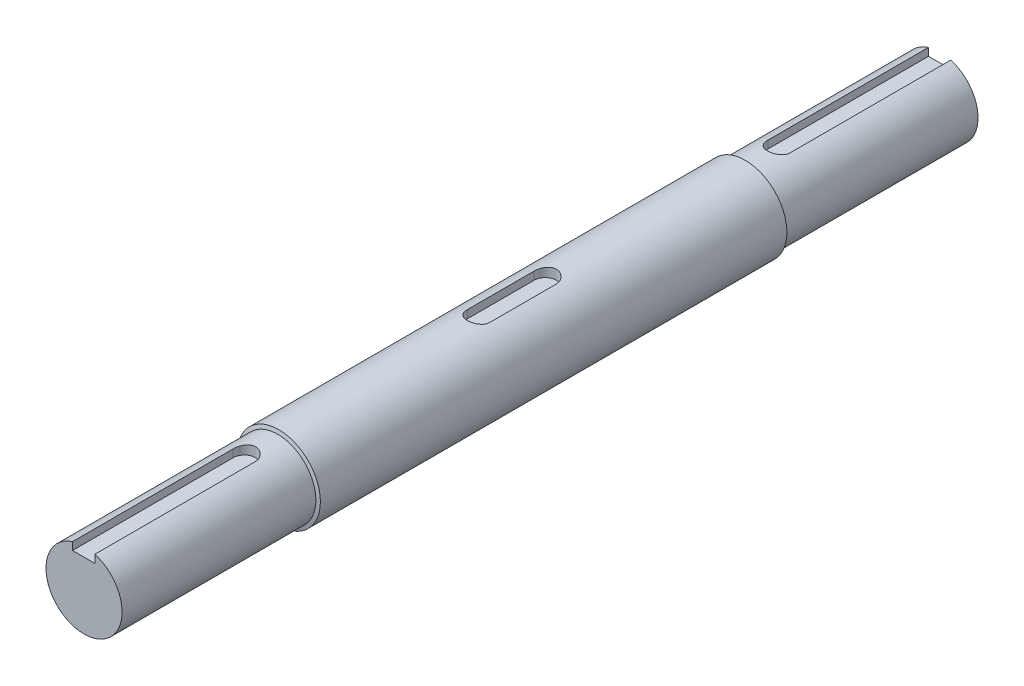
ISO-10303-21;
HEADER;
FILE_DESCRIPTION(('STEP AP214'),'2;1');
FILE_NAME('part.step','',(''),(''),'','','');
FILE_SCHEMA(('AUTOMOTIVE_DESIGN { 1 0 10303 214 1 1 1 1 }'));
ENDSEC;
DATA;
#1=APPLICATION_CONTEXT('core data for automotive mechanical design processes');
#2=APPLICATION_PROTOCOL_DEFINITION('international standard','automotive_design',2000,#1);
#3=PRODUCT_CONTEXT('',#1,'mechanical');
#4=PRODUCT('Part','Part','',(#3));
#5=PRODUCT_RELATED_PRODUCT_CATEGORY('part','',(#4));
#6=PRODUCT_DEFINITION_FORMATION('','',#4);
#7=PRODUCT_DEFINITION_CONTEXT('part definition',#1,'design');
#8=PRODUCT_DEFINITION('design','',#6,#7);
#9=PRODUCT_DEFINITION_SHAPE('','',#8);
#10=(LENGTH_UNIT() NAMED_UNIT(*) SI_UNIT(.MILLI.,.METRE.));
#11=(NAMED_UNIT(*) PLANE_ANGLE_UNIT() SI_UNIT($,.RADIAN.));
#12=(NAMED_UNIT(*) SI_UNIT($,.STERADIAN.) SOLID_ANGLE_UNIT());
#13=UNCERTAINTY_MEASURE_WITH_UNIT(LENGTH_MEASURE(1.E-05),#10,'distance_accuracy_value','');
#14=(GEOMETRIC_REPRESENTATION_CONTEXT(3) GLOBAL_UNCERTAINTY_ASSIGNED_CONTEXT((#13)) GLOBAL_UNIT_ASSIGNED_CONTEXT((#10,
#11,#12)) REPRESENTATION_CONTEXT('',''));
#15=CARTESIAN_POINT('',(0.,0.,0.));
#16=DIRECTION('',(0.,0.,1.));
#17=DIRECTION('',(1.,0.,0.));
#18=AXIS2_PLACEMENT_3D('',#15,#16,#17);
#19=CARTESIAN_POINT('',(0.,0.,180.));
#20=DIRECTION('',(0.,0.,-1.));
#21=DIRECTION('',(-1.,0.,0.));
#22=AXIS2_PLACEMENT_3D('',#19,#20,#21);
#23=CYLINDRICAL_SURFACE('',#22,8.75);
#24=CARTESIAN_POINT('',(0.,0.,40.95));
#25=DIRECTION('',(0.,0.,-1.));
#26=DIRECTION('',(-1.,0.,0.));
#27=AXIS2_PLACEMENT_3D('',#24,#25,#26);
#28=CIRCLE('',#27,8.75);
#29=CARTESIAN_POINT('',(-8.75,0.,40.95));
#30=VERTEX_POINT('',#29);
#31=EDGE_CURVE('E156',#30,#30,#28,.T.);
#32=ORIENTED_EDGE('',*,*,#31,.F.);
#33=EDGE_LOOP('',(#32));
#34=FACE_BOUND('',#33,.T.);
#35=CARTESIAN_POINT('',(-2.34999999999999,8.42852300228219,97.));
#36=CARTESIAN_POINT('',(-2.35000771204887,8.4285151174792,97.0648172031479));
#37=CARTESIAN_POINT('',(-2.34731846603423,8.42927051196659,97.1296297014604));
#38=CARTESIAN_POINT('',(-2.33660599132982,8.43224933902164,97.2587665927357));
#39=CARTESIAN_POINT('',(-2.32858376438728,8.43447249588425,97.323091075073));
#40=CARTESIAN_POINT('',(-2.30728834882773,8.44032201481819,97.4506593799532));
#41=CARTESIAN_POINT('',(-2.29402659181791,8.44394532166753,97.5139052445157));
#42=CARTESIAN_POINT('',(-2.26237773894829,8.45247973149428,97.6389952606388));
#43=CARTESIAN_POINT('',(-2.24399055073495,8.4573908576764,97.70083938692));
#44=CARTESIAN_POINT('',(-2.18135092398383,8.47384783119091,97.8836024908178));
#45=CARTESIAN_POINT('',(-2.12959682925498,8.48712416960618,98.001892160052));
#46=CARTESIAN_POINT('',(-2.0076925166483,8.51678234776292,98.2280936899011));
#47=CARTESIAN_POINT('',(-1.9375360868314,8.53316523564069,98.3360020293245));
#48=CARTESIAN_POINT('',(-1.77891363685566,8.56765357847724,98.541150977134));
#49=CARTESIAN_POINT('',(-1.69006718175684,8.5857897557295,98.6380928370493));
#50=CARTESIAN_POINT('',(-1.49740282381337,8.62147716733614,98.8158954324731));
#51=CARTESIAN_POINT('',(-1.39358249043802,8.63902830615774,98.8967535522212));
#52=CARTESIAN_POINT('',(-1.17182881312,8.67191238058831,99.0413512176625));
#53=CARTESIAN_POINT('',(-1.05369341466077,8.68720460121444,99.1047909900506));
#54=CARTESIAN_POINT('',(-0.807959753714074,8.71349215200275,99.2107909503317));
#55=CARTESIAN_POINT('',(-0.680363561497582,8.72448841895047,99.2533556907996));
#56=CARTESIAN_POINT('',(-0.422467970577286,8.74072764178795,99.3154266767051));
#57=CARTESIAN_POINT('',(-0.292300027050153,8.74609819441226,99.3354451241938));
#58=CARTESIAN_POINT('',(-0.030347109309733,8.75092723361248,99.3534672046057));
#59=CARTESIAN_POINT('',(0.10143762269478,8.75038659518875,99.3514740957754));
#60=CARTESIAN_POINT('',(0.359310851304423,8.74354724609422,99.3258886015563));
#61=CARTESIAN_POINT('',(0.485458821243554,8.73739620732177,99.3028501297881));
#62=CARTESIAN_POINT('',(0.732026606865527,8.72020183006266,99.2367235542361));
#63=CARTESIAN_POINT('',(0.852446148769855,8.70915825800697,99.1936344932343));
#64=CARTESIAN_POINT('',(1.08555024748539,8.68320131789818,99.0882075948791));
#65=CARTESIAN_POINT('',(1.19814487031626,8.66825016135818,99.0256805966078));
#66=CARTESIAN_POINT('',(1.41142943998828,8.6360880788214,98.8832990555831));
#67=CARTESIAN_POINT('',(1.51211726691846,8.61887675156686,98.8034414344032));
#68=CARTESIAN_POINT('',(1.7020286722977,8.58342761101692,98.6257394572387));
#69=CARTESIAN_POINT('',(1.79079960347115,8.56517451788743,98.527413891673));
#70=CARTESIAN_POINT('',(1.95072314362797,8.53017594794363,98.3170557481245));
#71=CARTESIAN_POINT('',(2.02187086871643,8.5134308898654,98.2050193833099));
#72=CARTESIAN_POINT('',(2.14488641866991,8.48327861851133,97.9694080433701));
#73=CARTESIAN_POINT('',(2.1966186826984,8.46989508250728,97.8457592092002));
#74=CARTESIAN_POINT('',(2.27834723396409,8.44828094060744,97.5911402998802));
#75=CARTESIAN_POINT('',(2.30837619972965,8.44004259018832,97.4601815528779));
#76=CARTESIAN_POINT('',(2.33469186877106,8.4327788164002,97.2733793258763));
#77=CARTESIAN_POINT('',(2.34043288160869,8.43118569871097,97.2188299041686));
#78=CARTESIAN_POINT('',(2.34808291238573,8.42905806161571,97.1095291640811));
#79=CARTESIAN_POINT('',(2.34999797240023,8.42852187308899,97.0547783010573));
#80=CARTESIAN_POINT('',(2.35000000000001,8.42852300228219,97.));
#81=B_SPLINE_CURVE_WITH_KNOTS('',3,(#35,#36,#37,#38,#39,#40,#41,#42,#43,#44,#45,#46,#47,#48,#49,
#50,#51,#52,#53,#54,#55,#56,#57,#58,#59,#60,#61,#62,#63,#64,#65,#66,#67,#68,#69,#70,#71,#72,#73,
#74,#75,#76,#77,#78,#79,#80),.UNSPECIFIED.,.F.,.F.,(4,2,2,2,2,2,2,2,2,2,2,2,2,2,2,2,2,2,2,2,2,2,
4),(0.,0.194383367532063,0.38873023240231,0.582655392353598,0.776584046807006,1.16402038978287,
1.55158768544152,1.94797731856433,2.34443136544133,2.74733270682689,3.1501461415145,
3.54361134286724,3.93701830256871,4.32036010008819,4.70372020027673,5.09093437952323,
5.47821739573037,5.87751700091898,6.27692713996469,6.67907629668806,7.08061867112352,
7.24512305897556,7.40936744988177),.UNSPECIFIED.);
#82=CARTESIAN_POINT('',(-2.34999999999999,8.4285230022822,97.));
#83=VERTEX_POINT('',#82);
#84=CARTESIAN_POINT('',(2.35000000000001,8.42852300228218,97.));
#85=VERTEX_POINT('',#84);
#86=EDGE_CURVE('E39',#83,#85,#81,.T.);
#87=ORIENTED_EDGE('',*,*,#86,.F.);
#88=DIRECTION('',(0.,0.,-1.));
#89=VECTOR('',#88,1.);
#90=CARTESIAN_POINT('',(-2.34999999999997,8.4285230022822,180.));
#91=LINE('',#90,#89);
#92=CARTESIAN_POINT('',(-2.34999999999997,8.4285230022822,83.));
#93=VERTEX_POINT('',#92);
#94=EDGE_CURVE('E220',#93,#83,#91,.F.);
#95=ORIENTED_EDGE('',*,*,#94,.F.);
#96=CARTESIAN_POINT('',(2.35,8.42852300228219,83.));
#97=CARTESIAN_POINT('',(2.35000771204888,8.4285151174792,82.935182796852));
#98=CARTESIAN_POINT('',(2.34731846603423,8.42927051196659,82.8703702985396));
#99=CARTESIAN_POINT('',(2.33660599132982,8.43224933902164,82.7412334072642));
#100=CARTESIAN_POINT('',(2.32858376438729,8.43447249588425,82.676908924927));
#101=CARTESIAN_POINT('',(2.30728834882773,8.44032201481819,82.5493406200468));
#102=CARTESIAN_POINT('',(2.29402659181792,8.44394532166753,82.4860947554842));
#103=CARTESIAN_POINT('',(2.26237773894829,8.45247973149428,82.3610047393612));
#104=CARTESIAN_POINT('',(2.24399055073495,8.4573908576764,82.29916061308));
#105=CARTESIAN_POINT('',(2.18135092398383,8.47384783119091,82.1163975091822));
#106=CARTESIAN_POINT('',(2.12959682925498,8.48712416960618,81.998107839948));
#107=CARTESIAN_POINT('',(2.0076925166483,8.51678234776292,81.7719063100989));
#108=CARTESIAN_POINT('',(1.9375360868314,8.53316523564069,81.6639979706755));
#109=CARTESIAN_POINT('',(1.77891363685565,8.56765357847724,81.458849022866));
#110=CARTESIAN_POINT('',(1.69006718175684,8.5857897557295,81.3619071629507));
#111=CARTESIAN_POINT('',(1.49740282381336,8.62147716733614,81.1841045675269));
#112=CARTESIAN_POINT('',(1.393582490438,8.63902830615774,81.1032464477788));
#113=CARTESIAN_POINT('',(1.17182881311999,8.67191238058831,80.9586487823375));
#114=CARTESIAN_POINT('',(1.05369341466076,8.68720460121444,80.8952090099493));
#115=CARTESIAN_POINT('',(0.807959753714069,8.71349215200275,80.7892090496683));
#116=CARTESIAN_POINT('',(0.680363561497575,8.72448841895047,80.7466443092004));
#117=CARTESIAN_POINT('',(0.42246797057728,8.74072764178796,80.6845733232949));
#118=CARTESIAN_POINT('',(0.292300027050149,8.74609819441226,80.6645548758062));
#119=CARTESIAN_POINT('',(0.0303471093097319,8.75092723361248,80.6465327953943));
#120=CARTESIAN_POINT('',(-0.101437622694781,8.75038659518875,80.6485259042246));
#121=CARTESIAN_POINT('',(-0.359310851304425,8.74354724609422,80.6741113984437));
#122=CARTESIAN_POINT('',(-0.485458821243558,8.73739620732177,80.6971498702119));
#123=CARTESIAN_POINT('',(-0.732026606865533,8.72020183006265,80.7632764457639));
#124=CARTESIAN_POINT('',(-0.852446148769862,8.70915825800697,80.8063655067657));
#125=CARTESIAN_POINT('',(-1.0855502474854,8.68320131789818,80.9117924051209));
#126=CARTESIAN_POINT('',(-1.19814487031626,8.66825016135818,80.9743194033922));
#127=CARTESIAN_POINT('',(-1.41142943998828,8.6360880788214,81.116700944417));
#128=CARTESIAN_POINT('',(-1.51211726691846,8.61887675156686,81.1965585655968));
#129=CARTESIAN_POINT('',(-1.7020286722977,8.58342761101692,81.3742605427613));
#130=CARTESIAN_POINT('',(-1.79079960347115,8.56517451788743,81.472586108327));
#131=CARTESIAN_POINT('',(-1.95072314362797,8.53017594794363,81.6829442518755));
#132=CARTESIAN_POINT('',(-2.02187086871643,8.5134308898654,81.7949806166901));
#133=CARTESIAN_POINT('',(-2.14488641866991,8.48327861851133,82.0305919566299));
#134=CARTESIAN_POINT('',(-2.1966186826984,8.46989508250728,82.1542407907998));
#135=CARTESIAN_POINT('',(-2.27834723396408,8.44828094060744,82.4088597001198));
#136=CARTESIAN_POINT('',(-2.30837619972965,8.44004259018832,82.5398184471221));
#137=CARTESIAN_POINT('',(-2.33469186877105,8.4327788164002,82.7266206741237));
#138=CARTESIAN_POINT('',(-2.34043288160868,8.43118569871098,82.7811700958314));
#139=CARTESIAN_POINT('',(-2.34808291238573,8.42905806161571,82.8904708359189));
#140=CARTESIAN_POINT('',(-2.34999797240022,8.42852187308899,82.9452216989427));
#141=CARTESIAN_POINT('',(-2.35,8.4285230022822,83.));
#142=B_SPLINE_CURVE_WITH_KNOTS('',3,(#96,#97,#98,#99,#100,#101,#102,#103,#104,#105,#106,#107,
#108,#109,#110,#111,#112,#113,#114,#115,#116,#117,#118,#119,#120,#121,#122,#123,#124,#125,#126,
#127,#128,#129,#130,#131,#132,#133,#134,#135,#136,#137,#138,#139,#140,#141),.UNSPECIFIED.,.F.,
.F.,(4,2,2,2,2,2,2,2,2,2,2,2,2,2,2,2,2,2,2,2,2,2,4),(0.,0.194383367532078,0.388730232402296,
0.582655392353627,0.776584046807006,1.16402038978288,1.55158768544152,1.94797731856435,
2.34443136544134,2.7473327068269,3.1501461415145,3.54361134286724,3.93701830256871,
4.32036010008819,4.70372020027673,5.09093437952324,5.47821739573038,5.87751700091899,
6.27692713996469,6.67907629668807,7.08061867112353,7.24512305897556,7.40936744988174),.UNSPECIFIED.);
#143=CARTESIAN_POINT('',(2.35,8.42852300228219,83.));
#144=VERTEX_POINT('',#143);
#145=EDGE_CURVE('E223',#144,#93,#142,.T.);
#146=ORIENTED_EDGE('',*,*,#145,.F.);
#147=DIRECTION('',(0.,0.,-1.));
#148=VECTOR('',#147,1.);
#149=CARTESIAN_POINT('',(2.35000000000003,8.42852300228218,180.));
#150=LINE('',#149,#148);
#151=EDGE_CURVE('E235',#85,#144,#150,.T.);
#152=ORIENTED_EDGE('',*,*,#151,.F.);
#153=EDGE_LOOP('',(#87,#95,#146,#152));
#154=FACE_BOUND('',#153,.T.);
#155=CARTESIAN_POINT('',(0.,0.,139.05));
#156=DIRECTION('',(0.,0.,1.));
#157=DIRECTION('',(1.,0.,0.));
#158=AXIS2_PLACEMENT_3D('',#155,#156,#157);
#159=CIRCLE('',#158,8.75);
#160=CARTESIAN_POINT('',(8.75,0.,139.05));
#161=VERTEX_POINT('',#160);
#162=EDGE_CURVE('E218',#161,#161,#159,.T.);
#163=ORIENTED_EDGE('',*,*,#162,.F.);
#164=EDGE_LOOP('',(#163));
#165=FACE_BOUND('',#164,.T.);
#166=ADVANCED_FACE('F35',(#34,#154,#165),#23,.T.);
#167=CARTESIAN_POINT('',(0.,40.55,97.));
#168=DIRECTION('',(0.,-1.,0.));
#169=DIRECTION('',(0.,0.,-1.));
#170=AXIS2_PLACEMENT_3D('',#167,#168,#169);
#171=CYLINDRICAL_SURFACE('',#170,2.35);
#172=ORIENTED_EDGE('',*,*,#86,.T.);
#173=DIRECTION('',(0.,-1.,0.));
#174=VECTOR('',#173,1.);
#175=CARTESIAN_POINT('',(2.35000000000001,40.55,97.));
#176=LINE('',#175,#174);
#177=CARTESIAN_POINT('',(2.35000000000001,6.75,97.));
#178=VERTEX_POINT('',#177);
#179=EDGE_CURVE('E132',#85,#178,#176,.T.);
#180=ORIENTED_EDGE('',*,*,#179,.T.);
#181=CARTESIAN_POINT('',(0.,6.75,97.));
#182=DIRECTION('',(0.,1.,0.));
#183=DIRECTION('',(0.,0.,1.));
#184=AXIS2_PLACEMENT_3D('',#181,#182,#183);
#185=CIRCLE('',#184,2.35);
#186=CARTESIAN_POINT('',(-2.34999999999999,6.75,97.));
#187=VERTEX_POINT('',#186);
#188=EDGE_CURVE('E137',#187,#178,#185,.T.);
#189=ORIENTED_EDGE('',*,*,#188,.F.);
#190=DIRECTION('',(0.,-1.,0.));
#191=VECTOR('',#190,1.);
#192=CARTESIAN_POINT('',(-2.34999999999999,40.55,97.));
#193=LINE('',#192,#191);
#194=EDGE_CURVE('E164',#83,#187,#193,.T.);
#195=ORIENTED_EDGE('',*,*,#194,.F.);
#196=EDGE_LOOP('',(#172,#180,#189,#195));
#197=FACE_BOUND('',#196,.T.);
#198=ADVANCED_FACE('F134',(#197),#171,.F.);
#199=CARTESIAN_POINT('',(2.35000000000001,40.55,97.));
#200=DIRECTION('',(-1.,0.,0.));
#201=DIRECTION('',(0.,0.,1.));
#202=AXIS2_PLACEMENT_3D('',#199,#200,#201);
#203=PLANE('',#202);
#204=ORIENTED_EDGE('',*,*,#151,.T.);
#205=DIRECTION('',(0.,-1.,0.));
#206=VECTOR('',#205,1.);
#207=CARTESIAN_POINT('',(2.35,40.55,83.));
#208=LINE('',#207,#206);
#209=CARTESIAN_POINT('',(2.35,6.75,83.));
#210=VERTEX_POINT('',#209);
#211=EDGE_CURVE('E142',#144,#210,#208,.T.);
#212=ORIENTED_EDGE('',*,*,#211,.T.);
#213=DIRECTION('',(0.,0.,-1.));
#214=VECTOR('',#213,1.);
#215=CARTESIAN_POINT('',(2.35000000000001,6.75,97.));
#216=LINE('',#215,#214);
#217=EDGE_CURVE('E145',#178,#210,#216,.T.);
#218=ORIENTED_EDGE('',*,*,#217,.F.);
#219=ORIENTED_EDGE('',*,*,#179,.F.);
#220=EDGE_LOOP('',(#204,#212,#218,#219));
#221=FACE_BOUND('',#220,.T.);
#222=ADVANCED_FACE('F146',(#221),#203,.T.);
#223=CARTESIAN_POINT('',(0.,40.55,83.));
#224=DIRECTION('',(0.,-1.,0.));
#225=DIRECTION('',(0.,0.,-1.));
#226=AXIS2_PLACEMENT_3D('',#223,#224,#225);
#227=CYLINDRICAL_SURFACE('',#226,2.35);
#228=ORIENTED_EDGE('',*,*,#145,.T.);
#229=DIRECTION('',(0.,-1.,0.));
#230=VECTOR('',#229,1.);
#231=CARTESIAN_POINT('',(-2.35,40.55,83.));
#232=LINE('',#231,#230);
#233=CARTESIAN_POINT('',(-2.35,6.75,83.));
#234=VERTEX_POINT('',#233);
#235=EDGE_CURVE('E57',#93,#234,#232,.T.);
#236=ORIENTED_EDGE('',*,*,#235,.T.);
#237=CARTESIAN_POINT('',(0.,6.75,83.));
#238=DIRECTION('',(0.,1.,0.));
#239=DIRECTION('',(0.,0.,1.));
#240=AXIS2_PLACEMENT_3D('',#237,#238,#239);
#241=CIRCLE('',#240,2.35);
#242=EDGE_CURVE('E151',#210,#234,#241,.T.);
#243=ORIENTED_EDGE('',*,*,#242,.F.);
#244=ORIENTED_EDGE('',*,*,#211,.F.);
#245=EDGE_LOOP('',(#228,#236,#243,#244));
#246=FACE_BOUND('',#245,.T.);
#247=ADVANCED_FACE('F236',(#246),#227,.F.);
#248=CARTESIAN_POINT('',(-2.34999999999999,40.55,97.));
#249=DIRECTION('',(1.,0.,0.));
#250=DIRECTION('',(0.,0.,-1.));
#251=AXIS2_PLACEMENT_3D('',#248,#249,#250);
#252=PLANE('',#251);
#253=ORIENTED_EDGE('',*,*,#94,.T.);
#254=ORIENTED_EDGE('',*,*,#194,.T.);
#255=DIRECTION('',(0.,0.,1.));
#256=VECTOR('',#255,1.);
#257=CARTESIAN_POINT('',(-2.34999999999999,6.75,97.));
#258=LINE('',#257,#256);
#259=EDGE_CURVE('E155',#234,#187,#258,.T.);
#260=ORIENTED_EDGE('',*,*,#259,.F.);
#261=ORIENTED_EDGE('',*,*,#235,.F.);
#262=EDGE_LOOP('',(#253,#254,#260,#261));
#263=FACE_BOUND('',#262,.T.);
#264=ADVANCED_FACE('F240',(#263),#252,.T.);
#265=CARTESIAN_POINT('',(0.,6.75,97.));
#266=DIRECTION('',(0.,1.,0.));
#267=DIRECTION('',(0.,0.,1.));
#268=AXIS2_PLACEMENT_3D('',#265,#266,#267);
#269=PLANE('',#268);
#270=ORIENTED_EDGE('',*,*,#188,.T.);
#271=ORIENTED_EDGE('',*,*,#217,.T.);
#272=ORIENTED_EDGE('',*,*,#242,.T.);
#273=ORIENTED_EDGE('',*,*,#259,.T.);
#274=EDGE_LOOP('',(#270,#271,#272,#273));
#275=FACE_BOUND('',#274,.T.);
#276=ADVANCED_FACE('F154',(#275),#269,.T.);
#277=CARTESIAN_POINT('',(0.,0.,40.95));
#278=DIRECTION('',(0.,0.,1.));
#279=DIRECTION('',(-1.,0.,0.));
#280=AXIS2_PLACEMENT_3D('',#277,#278,#279);
#281=CONICAL_SURFACE('',#280,8.75,1.30899693899575);
#282=ORIENTED_EDGE('',*,*,#31,.T.);
#283=EDGE_LOOP('',(#282));
#284=FACE_BOUND('',#283,.T.);
#285=CARTESIAN_POINT('',(0.,0.,40.7490381056767));
#286=DIRECTION('',(0.,0.,1.));
#287=DIRECTION('',(1.,0.,0.));
#288=AXIS2_PLACEMENT_3D('',#285,#286,#287);
#289=CIRCLE('',#288,8.);
#290=CARTESIAN_POINT('',(8.,0.,40.7490381056767));
#291=VERTEX_POINT('',#290);
#292=EDGE_CURVE('E49',#291,#291,#289,.T.);
#293=ORIENTED_EDGE('',*,*,#292,.T.);
#294=EDGE_LOOP('',(#293));
#295=FACE_BOUND('',#294,.T.);
#296=ADVANCED_FACE('F199',(#284,#295),#281,.T.);
#297=CARTESIAN_POINT('',(-2.42304387145256,5.99955536626201,33.8));
#298=DIRECTION('',(0.,1.,0.));
#299=DIRECTION('',(-1.,0.,0.));
#300=AXIS2_PLACEMENT_3D('',#297,#298,#299);
#301=PLANE('',#300);
#302=DIRECTION('',(1.,0.,0.));
#303=VECTOR('',#302,1.);
#304=CARTESIAN_POINT('',(-2.42304387145256,5.99955536626201,0.));
#305=LINE('',#304,#303);
#306=CARTESIAN_POINT('',(-2.42304387145256,5.99955536626201,0.));
#307=VERTEX_POINT('',#306);
#308=CARTESIAN_POINT('',(2.27695612854744,5.99955536626201,0.));
#309=VERTEX_POINT('',#308);
#310=EDGE_CURVE('E458',#307,#309,#305,.T.);
#311=ORIENTED_EDGE('',*,*,#310,.F.);
#312=DIRECTION('',(0.,0.,-1.));
#313=VECTOR('',#312,1.);
#314=CARTESIAN_POINT('',(-2.42304387145256,5.99955536626201,33.8));
#315=LINE('',#314,#313);
#316=CARTESIAN_POINT('',(-2.42304387145256,5.99955536626201,33.8));
#317=VERTEX_POINT('',#316);
#318=EDGE_CURVE('E451',#317,#307,#315,.T.);
#319=ORIENTED_EDGE('',*,*,#318,.F.);
#320=CARTESIAN_POINT('',(-0.0730438714525563,5.99955536626201,33.8));
#321=DIRECTION('',(0.,-1.,0.));
#322=DIRECTION('',(1.,0.,0.));
#323=AXIS2_PLACEMENT_3D('',#320,#321,#322);
#324=CIRCLE('',#323,2.35);
#325=CARTESIAN_POINT('',(2.27695612854744,5.99955536626201,33.8));
#326=VERTEX_POINT('',#325);
#327=EDGE_CURVE('E141',#326,#317,#324,.T.);
#328=ORIENTED_EDGE('',*,*,#327,.F.);
#329=DIRECTION('',(0.,0.,-1.));
#330=VECTOR('',#329,1.);
#331=CARTESIAN_POINT('',(2.27695612854744,5.99955536626201,33.8));
#332=LINE('',#331,#330);
#333=EDGE_CURVE('E449',#326,#309,#332,.T.);
#334=ORIENTED_EDGE('',*,*,#333,.T.);
#335=EDGE_LOOP('',(#311,#319,#328,#334));
#336=FACE_BOUND('',#335,.T.);
#337=ADVANCED_FACE('F197',(#336),#301,.T.);
#338=CARTESIAN_POINT('',(0.,0.,0.));
#339=DIRECTION('',(0.,0.,1.));
#340=DIRECTION('',(1.,0.,0.));
#341=AXIS2_PLACEMENT_3D('',#338,#339,#340);
#342=PLANE('',#341);
#343=DIRECTION('',(0.,1.,0.));
#344=VECTOR('',#343,1.);
#345=CARTESIAN_POINT('',(2.27695612854744,5.99955536626201,0.));
#346=LINE('',#345,#344);
#347=CARTESIAN_POINT('',(2.27695612854744,7.66912451252881,0.));
#348=VERTEX_POINT('',#347);
#349=EDGE_CURVE('E65',#309,#348,#346,.T.);
#350=ORIENTED_EDGE('',*,*,#349,.T.);
#351=CARTESIAN_POINT('',(0.,0.,0.));
#352=DIRECTION('',(0.,0.,1.));
#353=DIRECTION('',(1.,0.,0.));
#354=AXIS2_PLACEMENT_3D('',#351,#352,#353);
#355=CIRCLE('',#354,8.);
#356=CARTESIAN_POINT('',(-2.42304387145256,7.62422838043406,0.));
#357=VERTEX_POINT('',#356);
#358=EDGE_CURVE('E440',#357,#348,#355,.T.);
#359=ORIENTED_EDGE('',*,*,#358,.F.);
#360=DIRECTION('',(0.,-1.,0.));
#361=VECTOR('',#360,1.);
#362=CARTESIAN_POINT('',(-2.42304387145256,5.99955536626201,0.));
#363=LINE('',#362,#361);
#364=EDGE_CURVE('E455',#357,#307,#363,.T.);
#365=ORIENTED_EDGE('',*,*,#364,.T.);
#366=ORIENTED_EDGE('',*,*,#310,.T.);
#367=EDGE_LOOP('',(#350,#359,#365,#366));
#368=FACE_BOUND('',#367,.T.);
#369=ADVANCED_FACE('F195',(#368),#342,.F.);
#370=CARTESIAN_POINT('',(-2.42304387145256,5.99955536626201,33.8));
#371=DIRECTION('',(1.,0.,0.));
#372=DIRECTION('',(0.,0.,-1.));
#373=AXIS2_PLACEMENT_3D('',#370,#371,#372);
#374=PLANE('',#373);
#375=ORIENTED_EDGE('',*,*,#364,.F.);
#376=DIRECTION('',(0.,0.,-1.));
#377=VECTOR('',#376,1.);
#378=CARTESIAN_POINT('',(-2.42304387145256,7.62422838043406,33.8));
#379=LINE('',#378,#377);
#380=CARTESIAN_POINT('',(-2.42304387145256,7.62422838043406,33.8));
#381=VERTEX_POINT('',#380);
#382=EDGE_CURVE('E446',#381,#357,#379,.T.);
#383=ORIENTED_EDGE('',*,*,#382,.F.);
#384=DIRECTION('',(0.,-1.,0.));
#385=VECTOR('',#384,1.);
#386=CARTESIAN_POINT('',(-2.42304387145256,5.99955536626201,33.8));
#387=LINE('',#386,#385);
#388=EDGE_CURVE('E452',#381,#317,#387,.T.);
#389=ORIENTED_EDGE('',*,*,#388,.T.);
#390=ORIENTED_EDGE('',*,*,#318,.T.);
#391=EDGE_LOOP('',(#375,#383,#389,#390));
#392=FACE_BOUND('',#391,.T.);
#393=ADVANCED_FACE('F189',(#392),#374,.T.);
#394=CARTESIAN_POINT('',(-0.0730438714525625,39.799555366262,33.8));
#395=DIRECTION('',(0.,-1.,0.));
#396=DIRECTION('',(1.,0.,0.));
#397=AXIS2_PLACEMENT_3D('',#394,#395,#396);
#398=CYLINDRICAL_SURFACE('',#397,2.35);
#399=DIRECTION('',(0.,1.,0.));
#400=VECTOR('',#399,1.);
#401=CARTESIAN_POINT('',(2.27695612854744,5.99955536626201,33.8));
#402=LINE('',#401,#400);
#403=CARTESIAN_POINT('',(2.27695612854744,7.66912451252881,33.8));
#404=VERTEX_POINT('',#403);
#405=EDGE_CURVE('E178',#326,#404,#402,.T.);
#406=ORIENTED_EDGE('',*,*,#405,.F.);
#407=ORIENTED_EDGE('',*,*,#327,.T.);
#408=ORIENTED_EDGE('',*,*,#388,.F.);
#409=CARTESIAN_POINT('',(2.27695612854744,7.66912451252881,33.8));
#410=CARTESIAN_POINT('',(2.2769640135783,7.66911587085887,33.8646733280028));
#411=CARTESIAN_POINT('',(2.27428650015957,7.66991696733197,33.9293416916213));
#412=CARTESIAN_POINT('',(2.26362200822463,7.67307447427734,34.0581878195905));
#413=CARTESIAN_POINT('',(2.25563613604177,7.67543056066808,34.1223656833494));
#414=CARTESIAN_POINT('',(2.23444124328164,7.68162661702504,34.2496271785775));
#415=CARTESIAN_POINT('',(2.22124459010118,7.6854630729583,34.3127130344316));
#416=CARTESIAN_POINT('',(2.18975531437852,7.6944940090819,34.4374835462945));
#417=CARTESIAN_POINT('',(2.17146257659311,7.69968851998323,34.4991681705817));
#418=CARTESIAN_POINT('',(2.10915706050952,7.71708105855644,34.6814457088152));
#419=CARTESIAN_POINT('',(2.05769144114741,7.73109605226993,34.7994140592994));
#420=CARTESIAN_POINT('',(1.93648674134472,7.76233935200834,35.0250405020278));
#421=CARTESIAN_POINT('',(1.86674018222231,7.77956897229487,35.1326943499676));
#422=CARTESIAN_POINT('',(1.70880852576126,7.81579748504219,35.3377467871462));
#423=CARTESIAN_POINT('',(1.62019499290732,7.83483050538054,35.4348100398425));
#424=CARTESIAN_POINT('',(1.4279566162613,7.87213520309781,35.6129189176019));
#425=CARTESIAN_POINT('',(1.32432941441634,7.89040676029947,35.6939620217977));
#426=CARTESIAN_POINT('',(1.10277146607443,7.92443387465123,35.8390654623632));
#427=CARTESIAN_POINT('',(0.984624514388802,7.94014050449578,35.9028081687997));
#428=CARTESIAN_POINT('',(0.738756232563629,7.96677493568309,36.0093940029861));
#429=CARTESIAN_POINT('',(0.611037355399619,7.97770395650058,36.0522424642713));
#430=CARTESIAN_POINT('',(0.353439673253096,7.9932007637696,36.1146667660378));
#431=CARTESIAN_POINT('',(0.223720333286179,7.99793738843338,36.1348580762001));
#432=CARTESIAN_POINT('',(-0.037335821377816,8.00097697529954,36.1533678358036));
#433=CARTESIAN_POINT('',(-0.168672361817695,7.99928101380984,36.1516899443111));
#434=CARTESIAN_POINT('',(-0.425250312417258,7.98969233776509,36.1269271045815));
#435=CARTESIAN_POINT('',(-0.550558540404192,7.98197856840313,36.1044569008944));
#436=CARTESIAN_POINT('',(-0.795507137899052,7.96129923738091,36.0397760327402));
#437=CARTESIAN_POINT('',(-0.915147151199694,7.94833334614954,35.9975641294541));
#438=CARTESIAN_POINT('',(-1.14725282713353,7.91818830182002,35.894026542453));
#439=CARTESIAN_POINT('',(-1.25959784913815,7.90095389870251,35.8324471000347));
#440=CARTESIAN_POINT('',(-1.47255992322991,7.8640489214405,35.6921218961952));
#441=CARTESIAN_POINT('',(-1.57317434102737,7.84437780213116,35.6133722902985));
#442=CARTESIAN_POINT('',(-1.76384519322723,7.80376312798149,35.4374214483325));
#443=CARTESIAN_POINT('',(-1.85335747069121,7.78279959745963,35.3396343652731));
#444=CARTESIAN_POINT('',(-2.01486284739926,7.74256260742018,35.1301616364714));
#445=CARTESIAN_POINT('',(-2.08685095250584,7.72328963068477,35.0184720423866));
#446=CARTESIAN_POINT('',(-2.21168797633118,7.68847741919268,34.7831524411477));
#447=CARTESIAN_POINT('',(-2.264379633696,7.67296919633394,34.6594342887651));
#448=CARTESIAN_POINT('',(-2.34794696596216,7.64781548431772,34.4043657816786));
#449=CARTESIAN_POINT('',(-2.37885676593176,7.6381608278592,34.2730277159134));
#450=CARTESIAN_POINT('',(-2.40655096364935,7.62945399405284,34.0837238728636));
#451=CARTESIAN_POINT('',(-2.4127352801698,7.62749838599502,34.0271317387844));
#452=CARTESIAN_POINT('',(-2.42097787232979,7.62488559725774,33.913702598419));
#453=CARTESIAN_POINT('',(-2.42304226231399,7.62422649247073,33.856866080648));
#454=CARTESIAN_POINT('',(-2.42304387145256,7.62422838043406,33.8));
#455=B_SPLINE_CURVE_WITH_KNOTS('',3,(#409,#410,#411,#412,#413,#414,#415,#416,#417,#418,#419,
#420,#421,#422,#423,#424,#425,#426,#427,#428,#429,#430,#431,#432,#433,#434,#435,#436,#437,#438,
#439,#440,#441,#442,#443,#444,#445,#446,#447,#448,#449,#450,#451,#452,#453,#454),.UNSPECIFIED.,
.F.,.F.,(4,2,2,2,2,2,2,2,2,2,2,2,2,2,2,2,2,2,2,2,2,2,4),(0.,0.193951137962387,0.387861866567669,
0.581315102657119,0.774772713866704,1.16123141593252,1.54784846461781,1.94441802448495,
2.34104993738374,2.74453501547863,3.14791704462984,3.54005404061439,3.93212542666703,
4.31296296243959,4.6938243995035,5.07989987713798,5.46606188771175,5.86684851762621,
6.26774923260933,6.67184807643299,7.07531241311083,7.2460645313789,7.41656304900747),.UNSPECIFIED.);
#456=EDGE_CURVE('E169',#404,#381,#455,.T.);
#457=ORIENTED_EDGE('',*,*,#456,.F.);
#458=EDGE_LOOP('',(#406,#407,#408,#457));
#459=FACE_BOUND('',#458,.T.);
#460=ADVANCED_FACE('F184',(#459),#398,.F.);
#461=CARTESIAN_POINT('',(2.27695612854744,5.99955536626201,33.8));
#462=DIRECTION('',(-1.,0.,0.));
#463=DIRECTION('',(0.,0.,1.));
#464=AXIS2_PLACEMENT_3D('',#461,#462,#463);
#465=PLANE('',#464);
#466=ORIENTED_EDGE('',*,*,#349,.F.);
#467=ORIENTED_EDGE('',*,*,#333,.F.);
#468=ORIENTED_EDGE('',*,*,#405,.T.);
#469=DIRECTION('',(0.,0.,-1.));
#470=VECTOR('',#469,1.);
#471=CARTESIAN_POINT('',(2.27695612854744,7.66912451252881,33.8));
#472=LINE('',#471,#470);
#473=EDGE_CURVE('E442',#404,#348,#472,.T.);
#474=ORIENTED_EDGE('',*,*,#473,.T.);
#475=EDGE_LOOP('',(#466,#467,#468,#474));
#476=FACE_BOUND('',#475,.T.);
#477=ADVANCED_FACE('F188',(#476),#465,.T.);
#478=CARTESIAN_POINT('',(0.,0.,40.95));
#479=DIRECTION('',(0.,0.,-1.));
#480=DIRECTION('',(-1.,0.,0.));
#481=AXIS2_PLACEMENT_3D('',#478,#479,#480);
#482=CYLINDRICAL_SURFACE('',#481,8.);
#483=ORIENTED_EDGE('',*,*,#473,.F.);
#484=ORIENTED_EDGE('',*,*,#456,.T.);
#485=ORIENTED_EDGE('',*,*,#382,.T.);
#486=ORIENTED_EDGE('',*,*,#358,.T.);
#487=EDGE_LOOP('',(#483,#484,#485,#486));
#488=FACE_BOUND('',#487,.T.);
#489=ORIENTED_EDGE('',*,*,#292,.F.);
#490=EDGE_LOOP('',(#489));
#491=FACE_BOUND('',#490,.T.);
#492=ADVANCED_FACE('F180',(#488,#491),#482,.T.);
#493=CARTESIAN_POINT('',(0.,0.,139.05));
#494=DIRECTION('',(0.,0.,-1.));
#495=DIRECTION('',(-1.,0.,0.));
#496=AXIS2_PLACEMENT_3D('',#493,#494,#495);
#497=CONICAL_SURFACE('',#496,8.75,1.30899693899575);
#498=CARTESIAN_POINT('',(0.,0.,139.250961894323));
#499=DIRECTION('',(0.,0.,-1.));
#500=DIRECTION('',(-1.,0.,0.));
#501=AXIS2_PLACEMENT_3D('',#498,#499,#500);
#502=CIRCLE('',#501,8.);
#503=CARTESIAN_POINT('',(-8.,0.,139.250961894323));
#504=VERTEX_POINT('',#503);
#505=EDGE_CURVE('E11',#504,#504,#502,.T.);
#506=ORIENTED_EDGE('',*,*,#505,.T.);
#507=EDGE_LOOP('',(#506));
#508=FACE_BOUND('',#507,.T.);
#509=ORIENTED_EDGE('',*,*,#162,.T.);
#510=EDGE_LOOP('',(#509));
#511=FACE_BOUND('',#510,.T.);
#512=ADVANCED_FACE('F205',(#508,#511),#497,.T.);
#513=CARTESIAN_POINT('',(-2.42304387145256,5.99955536626201,146.2));
#514=DIRECTION('',(0.,-1.,0.));
#515=DIRECTION('',(1.,0.,0.));
#516=AXIS2_PLACEMENT_3D('',#513,#514,#515);
#517=PLANE('',#516);
#518=DIRECTION('',(1.,0.,0.));
#519=VECTOR('',#518,1.);
#520=CARTESIAN_POINT('',(-2.42304387145256,5.99955536626201,180.));
#521=LINE('',#520,#519);
#522=CARTESIAN_POINT('',(-2.42304387145256,5.99955536626201,180.));
#523=VERTEX_POINT('',#522);
#524=CARTESIAN_POINT('',(2.27695612854744,5.99955536626201,180.));
#525=VERTEX_POINT('',#524);
#526=EDGE_CURVE('E415',#523,#525,#521,.T.);
#527=ORIENTED_EDGE('',*,*,#526,.T.);
#528=DIRECTION('',(0.,0.,1.));
#529=VECTOR('',#528,1.);
#530=CARTESIAN_POINT('',(2.27695612854744,5.99955536626201,146.2));
#531=LINE('',#530,#529);
#532=CARTESIAN_POINT('',(2.27695612854744,5.99955536626201,146.2));
#533=VERTEX_POINT('',#532);
#534=EDGE_CURVE('E226',#533,#525,#531,.T.);
#535=ORIENTED_EDGE('',*,*,#534,.F.);
#536=CARTESIAN_POINT('',(-0.0730438714525563,5.99955536626201,146.2));
#537=DIRECTION('',(0.,1.,0.));
#538=DIRECTION('',(1.,0.,0.));
#539=AXIS2_PLACEMENT_3D('',#536,#537,#538);
#540=CIRCLE('',#539,2.35);
#541=CARTESIAN_POINT('',(-2.42304387145256,5.99955536626201,146.2));
#542=VERTEX_POINT('',#541);
#543=EDGE_CURVE('E410',#533,#542,#540,.T.);
#544=ORIENTED_EDGE('',*,*,#543,.T.);
#545=DIRECTION('',(0.,0.,1.));
#546=VECTOR('',#545,1.);
#547=CARTESIAN_POINT('',(-2.42304387145256,5.99955536626201,146.2));
#548=LINE('',#547,#546);
#549=EDGE_CURVE('E425',#542,#523,#548,.T.);
#550=ORIENTED_EDGE('',*,*,#549,.T.);
#551=EDGE_LOOP('',(#527,#535,#544,#550));
#552=FACE_BOUND('',#551,.T.);
#553=ADVANCED_FACE('F319',(#552),#517,.F.);
#554=CARTESIAN_POINT('',(0.,0.,180.));
#555=DIRECTION('',(0.,0.,1.));
#556=DIRECTION('',(1.,0.,0.));
#557=AXIS2_PLACEMENT_3D('',#554,#555,#556);
#558=PLANE('',#557);
#559=DIRECTION('',(0.,1.,0.));
#560=VECTOR('',#559,1.);
#561=CARTESIAN_POINT('',(2.27695612854744,5.99955536626201,180.));
#562=LINE('',#561,#560);
#563=CARTESIAN_POINT('',(2.27695612854744,7.66912451252881,180.));
#564=VERTEX_POINT('',#563);
#565=EDGE_CURVE('E409',#525,#564,#562,.T.);
#566=ORIENTED_EDGE('',*,*,#565,.F.);
#567=ORIENTED_EDGE('',*,*,#526,.F.);
#568=DIRECTION('',(0.,-1.,0.));
#569=VECTOR('',#568,1.);
#570=CARTESIAN_POINT('',(-2.42304387145256,5.99955536626201,180.));
#571=LINE('',#570,#569);
#572=CARTESIAN_POINT('',(-2.42304387145256,7.62422838043406,180.));
#573=VERTEX_POINT('',#572);
#574=EDGE_CURVE('E420',#573,#523,#571,.T.);
#575=ORIENTED_EDGE('',*,*,#574,.F.);
#576=CARTESIAN_POINT('',(0.,0.,180.));
#577=DIRECTION('',(0.,0.,1.));
#578=DIRECTION('',(1.,0.,0.));
#579=AXIS2_PLACEMENT_3D('',#576,#577,#578);
#580=CIRCLE('',#579,8.);
#581=EDGE_CURVE('E221',#573,#564,#580,.T.);
#582=ORIENTED_EDGE('',*,*,#581,.T.);
#583=EDGE_LOOP('',(#566,#567,#575,#582));
#584=FACE_BOUND('',#583,.T.);
#585=ADVANCED_FACE('F356',(#584),#558,.T.);
#586=CARTESIAN_POINT('',(2.27695612854744,5.99955536626201,146.2));
#587=DIRECTION('',(1.,0.,0.));
#588=DIRECTION('',(0.,0.,-1.));
#589=AXIS2_PLACEMENT_3D('',#586,#587,#588);
#590=PLANE('',#589);
#591=ORIENTED_EDGE('',*,*,#565,.T.);
#592=DIRECTION('',(0.,0.,1.));
#593=VECTOR('',#592,1.);
#594=CARTESIAN_POINT('',(2.27695612854744,7.66912451252881,146.2));
#595=LINE('',#594,#593);
#596=CARTESIAN_POINT('',(2.27695612854744,7.66912451252881,146.2));
#597=VERTEX_POINT('',#596);
#598=EDGE_CURVE('E418',#597,#564,#595,.T.);
#599=ORIENTED_EDGE('',*,*,#598,.F.);
#600=DIRECTION('',(0.,1.,0.));
#601=VECTOR('',#600,1.);
#602=CARTESIAN_POINT('',(2.27695612854744,5.99955536626201,146.2));
#603=LINE('',#602,#601);
#604=EDGE_CURVE('E412',#533,#597,#603,.T.);
#605=ORIENTED_EDGE('',*,*,#604,.F.);
#606=ORIENTED_EDGE('',*,*,#534,.T.);
#607=EDGE_LOOP('',(#591,#599,#605,#606));
#608=FACE_BOUND('',#607,.T.);
#609=ADVANCED_FACE('F349',(#608),#590,.F.);
#610=CARTESIAN_POINT('',(-0.0730438714525625,39.799555366262,146.2));
#611=DIRECTION('',(0.,-1.,0.));
#612=DIRECTION('',(1.,0.,0.));
#613=AXIS2_PLACEMENT_3D('',#610,#611,#612);
#614=CYLINDRICAL_SURFACE('',#613,2.35);
#615=DIRECTION('',(0.,-1.,0.));
#616=VECTOR('',#615,1.);
#617=CARTESIAN_POINT('',(-2.42304387145256,5.99955536626201,146.2));
#618=LINE('',#617,#616);
#619=CARTESIAN_POINT('',(-2.42304387145256,7.62422838043406,146.2));
#620=VERTEX_POINT('',#619);
#621=EDGE_CURVE('E414',#620,#542,#618,.T.);
#622=ORIENTED_EDGE('',*,*,#621,.T.);
#623=ORIENTED_EDGE('',*,*,#543,.F.);
#624=ORIENTED_EDGE('',*,*,#604,.T.);
#625=CARTESIAN_POINT('',(-2.42304387145256,7.62422838043406,146.2));
#626=CARTESIAN_POINT('',(-2.42305195103671,7.62421949388275,146.135551703236));
#627=CARTESIAN_POINT('',(-2.42039280315004,7.62507075726621,146.071108572569));
#628=CARTESIAN_POINT('',(-2.40980289521537,7.62842751439069,145.942714439213));
#629=CARTESIAN_POINT('',(-2.40187332649519,7.63093263429254,145.878763328612));
#630=CARTESIAN_POINT('',(-2.3808322555124,7.63752266903758,145.751967514035));
#631=CARTESIAN_POINT('',(-2.36773403188916,7.64160353510499,145.689120402601));
#632=CARTESIAN_POINT('',(-2.33648483257457,7.65121585433724,145.564825201229));
#633=CARTESIAN_POINT('',(-2.31833372390429,7.65674734567857,145.503377148157));
#634=CARTESIAN_POINT('',(-2.25652519929371,7.67528289771526,145.321812350849));
#635=CARTESIAN_POINT('',(-2.20548538754339,7.69023708467639,145.204312868031));
#636=CARTESIAN_POINT('',(-2.08532615687784,7.7236831262173,144.979549807103));
#637=CARTESIAN_POINT('',(-2.01619825488447,7.74217663959903,144.872291064065));
#638=CARTESIAN_POINT('',(-1.85946072670241,7.78133043630371,144.667584610134));
#639=CARTESIAN_POINT('',(-1.77137486732201,7.80203788176529,144.570509853313));
#640=CARTESIAN_POINT('',(-1.5802492829443,7.84298099187717,144.392262143761));
#641=CARTESIAN_POINT('',(-1.47720690521106,7.86321657209543,144.31109201794));
#642=CARTESIAN_POINT('',(-1.25627006826114,7.90155773188745,144.165207541216));
#643=CARTESIAN_POINT('',(-1.13809539279017,7.91960567354085,144.100901021989));
#644=CARTESIAN_POINT('',(-0.891994890150524,7.95108219628956,143.993226890521));
#645=CARTESIAN_POINT('',(-0.76407144163998,7.96451189983448,143.94985418934));
#646=CARTESIAN_POINT('',(-0.505751965513105,7.98501979733772,143.88645964093));
#647=CARTESIAN_POINT('',(-0.375516065768673,7.99225975898995,143.865838688457));
#648=CARTESIAN_POINT('',(-0.113241170773164,8.00027338524314,143.846669698618));
#649=CARTESIAN_POINT('',(0.0187974692331382,8.00104830592553,143.848117373423));
#650=CARTESIAN_POINT('',(0.276383586780416,7.99622911970963,143.872641283888));
#651=CARTESIAN_POINT('',(0.402002715160583,7.99084072061367,143.895014667961));
#652=CARTESIAN_POINT('',(0.647648164871342,7.97469193672139,143.959635054459));
#653=CARTESIAN_POINT('',(0.767674260966665,7.96393133578687,144.001882856481));
#654=CARTESIAN_POINT('',(1.00001556796209,7.938121173751,144.105395772129));
#655=CARTESIAN_POINT('',(1.11225172248116,7.92303391004599,144.166828501666));
#656=CARTESIAN_POINT('',(1.32504577068247,7.89023839336349,144.30683469095));
#657=CARTESIAN_POINT('',(1.42560125402626,7.87252960113504,144.385411678867));
#658=CARTESIAN_POINT('',(1.61599910591983,7.83570644879955,144.560798323342));
#659=CARTESIAN_POINT('',(1.70532652260987,7.81656444646856,144.658161791109));
#660=CARTESIAN_POINT('',(1.8665634662684,7.77964028183272,144.866661416895));
#661=CARTESIAN_POINT('',(1.93846793808396,7.76185851521291,144.977801558022));
#662=CARTESIAN_POINT('',(2.06345060610579,7.72957940310877,145.212210666142));
#663=CARTESIAN_POINT('',(2.11631919270416,7.71511922526833,145.33559665655));
#664=CARTESIAN_POINT('',(2.20032762407302,7.69158581383794,145.589954156975));
#665=CARTESIAN_POINT('',(2.23149969876964,7.68250459287077,145.720914101155));
#666=CARTESIAN_POINT('',(2.25983023897569,7.67419234802995,145.910901961273));
#667=CARTESIAN_POINT('',(2.26625203167353,7.67229607966218,145.96856171795));
#668=CARTESIAN_POINT('',(2.27481101883431,7.6697620087386,146.084138028592));
#669=CARTESIAN_POINT('',(2.27695468020544,7.66912230675519,146.142054062129));
#670=CARTESIAN_POINT('',(2.27695612854744,7.66912451252881,146.2));
#671=B_SPLINE_CURVE_WITH_KNOTS('',3,(#625,#626,#627,#628,#629,#630,#631,#632,#633,#634,#635,
#636,#637,#638,#639,#640,#641,#642,#643,#644,#645,#646,#647,#648,#649,#650,#651,#652,#653,#654,
#655,#656,#657,#658,#659,#660,#661,#662,#663,#664,#665,#666,#667,#668,#669,#670),.UNSPECIFIED.,
.F.,.F.,(4,2,2,2,2,2,2,2,2,2,2,2,2,2,2,2,2,2,2,2,2,2,4),(0.,0.193275636975521,0.386507600707145,
0.579246336489719,0.771990145138642,1.15699012526083,1.54217098998434,1.93847953170244,
2.33485845005659,2.7400865446155,3.14521607991615,3.53940227959632,3.93351189174973,
4.31484207438152,4.69618760019512,5.08096277473883,5.46581720817317,5.86450409601738,
6.26330652209875,6.66637488310165,7.06884320526038,7.24284195373579,7.41657748242565),.UNSPECIFIED.);
#672=EDGE_CURVE('E401',#620,#597,#671,.T.);
#673=ORIENTED_EDGE('',*,*,#672,.F.);
#674=EDGE_LOOP('',(#622,#623,#624,#673));
#675=FACE_BOUND('',#674,.T.);
#676=ADVANCED_FACE('F342',(#675),#614,.F.);
#677=CARTESIAN_POINT('',(-2.42304387145256,5.99955536626201,146.2));
#678=DIRECTION('',(-1.,0.,0.));
#679=DIRECTION('',(0.,0.,1.));
#680=AXIS2_PLACEMENT_3D('',#677,#678,#679);
#681=PLANE('',#680);
#682=ORIENTED_EDGE('',*,*,#574,.T.);
#683=ORIENTED_EDGE('',*,*,#549,.F.);
#684=ORIENTED_EDGE('',*,*,#621,.F.);
#685=DIRECTION('',(0.,0.,1.));
#686=VECTOR('',#685,1.);
#687=CARTESIAN_POINT('',(-2.42304387145256,7.62422838043406,146.2));
#688=LINE('',#687,#686);
#689=EDGE_CURVE('E427',#620,#573,#688,.T.);
#690=ORIENTED_EDGE('',*,*,#689,.T.);
#691=EDGE_LOOP('',(#682,#683,#684,#690));
#692=FACE_BOUND('',#691,.T.);
#693=ADVANCED_FACE('F330',(#692),#681,.F.);
#694=CARTESIAN_POINT('',(0.,0.,139.05));
#695=DIRECTION('',(0.,0.,1.));
#696=DIRECTION('',(1.,0.,0.));
#697=AXIS2_PLACEMENT_3D('',#694,#695,#696);
#698=CYLINDRICAL_SURFACE('',#697,8.);
#699=ORIENTED_EDGE('',*,*,#505,.F.);
#700=EDGE_LOOP('',(#699));
#701=FACE_BOUND('',#700,.T.);
#702=ORIENTED_EDGE('',*,*,#689,.F.);
#703=ORIENTED_EDGE('',*,*,#672,.T.);
#704=ORIENTED_EDGE('',*,*,#598,.T.);
#705=ORIENTED_EDGE('',*,*,#581,.F.);
#706=EDGE_LOOP('',(#702,#703,#704,#705));
#707=FACE_BOUND('',#706,.T.);
#708=ADVANCED_FACE('F326',(#701,#707),#698,.T.);
#709=CLOSED_SHELL('',(#166,#198,#222,#247,#264,#276,#296,#337,#369,#393,#460,#477,#492,#512,
#553,#585,#609,#676,#693,#708));
#710=MANIFOLD_SOLID_BREP('B2',#709);
#711=ADVANCED_BREP_SHAPE_REPRESENTATION('',(#18,#710),#14);
#712=SHAPE_DEFINITION_REPRESENTATION(#9,#711);
ENDSEC;
END-ISO-10303-21;
